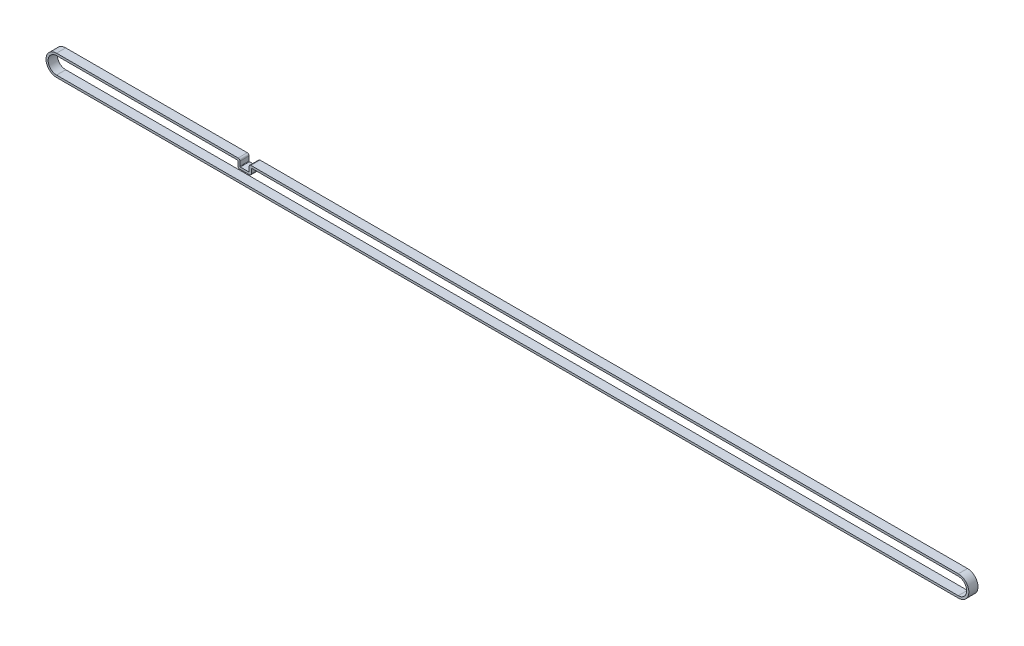
ISO-10303-21;
HEADER;
FILE_DESCRIPTION(('STEP AP214'),'2;1');
FILE_NAME('part.step','',(''),(''),'','','');
FILE_SCHEMA(('AUTOMOTIVE_DESIGN { 1 0 10303 214 1 1 1 1 }'));
ENDSEC;
DATA;
#1=APPLICATION_CONTEXT('core data for automotive mechanical design processes');
#2=APPLICATION_PROTOCOL_DEFINITION('international standard','automotive_design',2000,#1);
#3=PRODUCT_CONTEXT('',#1,'mechanical');
#4=PRODUCT('Part','Part','',(#3));
#5=PRODUCT_RELATED_PRODUCT_CATEGORY('part','',(#4));
#6=PRODUCT_DEFINITION_FORMATION('','',#4);
#7=PRODUCT_DEFINITION_CONTEXT('part definition',#1,'design');
#8=PRODUCT_DEFINITION('design','',#6,#7);
#9=PRODUCT_DEFINITION_SHAPE('','',#8);
#10=(LENGTH_UNIT() NAMED_UNIT(*) SI_UNIT(.MILLI.,.METRE.));
#11=(NAMED_UNIT(*) PLANE_ANGLE_UNIT() SI_UNIT($,.RADIAN.));
#12=(NAMED_UNIT(*) SI_UNIT($,.STERADIAN.) SOLID_ANGLE_UNIT());
#13=UNCERTAINTY_MEASURE_WITH_UNIT(LENGTH_MEASURE(1.E-05),#10,'distance_accuracy_value','');
#14=(GEOMETRIC_REPRESENTATION_CONTEXT(3) GLOBAL_UNCERTAINTY_ASSIGNED_CONTEXT((#13)) GLOBAL_UNIT_ASSIGNED_CONTEXT((#10,
#11,#12)) REPRESENTATION_CONTEXT('',''));
#15=CARTESIAN_POINT('',(0.,0.,0.));
#16=DIRECTION('',(0.,0.,1.));
#17=DIRECTION('',(1.,0.,0.));
#18=AXIS2_PLACEMENT_3D('',#15,#16,#17);
#19=CARTESIAN_POINT('',(0.,0.,6.));
#20=DIRECTION('',(0.,0.,1.));
#21=DIRECTION('',(1.,0.,0.));
#22=AXIS2_PLACEMENT_3D('',#19,#20,#21);
#23=PLANE('',#22);
#24=DIRECTION('',(-1.,0.,0.));
#25=VECTOR('',#24,1.);
#26=CARTESIAN_POINT('',(126.,6.9,6.));
#27=LINE('',#26,#25);
#28=CARTESIAN_POINT('',(590.,6.9,6.));
#29=VERTEX_POINT('',#28);
#30=CARTESIAN_POINT('',(127.2,6.9,6.));
#31=VERTEX_POINT('',#30);
#32=EDGE_CURVE('E270',#29,#31,#27,.T.);
#33=ORIENTED_EDGE('',*,*,#32,.T.);
#34=CARTESIAN_POINT('',(127.2,5.7,6.));
#35=DIRECTION('',(0.,0.,1.));
#36=DIRECTION('',(1.,0.,0.));
#37=AXIS2_PLACEMENT_3D('',#34,#35,#36);
#38=CIRCLE('',#37,1.2);
#39=CARTESIAN_POINT('',(126.,5.7,6.));
#40=VERTEX_POINT('',#39);
#41=EDGE_CURVE('E367',#31,#40,#38,.T.);
#42=ORIENTED_EDGE('',*,*,#41,.T.);
#43=DIRECTION('',(0.,-1.,0.));
#44=VECTOR('',#43,1.);
#45=CARTESIAN_POINT('',(126.,2.5,6.));
#46=LINE('',#45,#44);
#47=CARTESIAN_POINT('',(126.,2.8,6.));
#48=VERTEX_POINT('',#47);
#49=EDGE_CURVE('E273',#40,#48,#46,.T.);
#50=ORIENTED_EDGE('',*,*,#49,.T.);
#51=CARTESIAN_POINT('',(125.7,2.8,6.));
#52=DIRECTION('',(0.,0.,1.));
#53=DIRECTION('',(1.,0.,0.));
#54=AXIS2_PLACEMENT_3D('',#51,#52,#53);
#55=CIRCLE('',#54,0.3);
#56=CARTESIAN_POINT('',(125.7,2.5,6.));
#57=VERTEX_POINT('',#56);
#58=EDGE_CURVE('E345',#48,#57,#55,.F.);
#59=ORIENTED_EDGE('',*,*,#58,.T.);
#60=DIRECTION('',(-1.,0.,0.));
#61=VECTOR('',#60,1.);
#62=CARTESIAN_POINT('',(120.,2.5,6.));
#63=LINE('',#62,#61);
#64=CARTESIAN_POINT('',(120.3,2.5,6.));
#65=VERTEX_POINT('',#64);
#66=EDGE_CURVE('E275',#57,#65,#63,.T.);
#67=ORIENTED_EDGE('',*,*,#66,.T.);
#68=CARTESIAN_POINT('',(120.3,2.8,6.));
#69=DIRECTION('',(0.,0.,1.));
#70=DIRECTION('',(1.,0.,0.));
#71=AXIS2_PLACEMENT_3D('',#68,#69,#70);
#72=CIRCLE('',#71,0.3);
#73=CARTESIAN_POINT('',(120.,2.8,6.));
#74=VERTEX_POINT('',#73);
#75=EDGE_CURVE('E349',#65,#74,#72,.F.);
#76=ORIENTED_EDGE('',*,*,#75,.T.);
#77=DIRECTION('',(0.,1.,0.));
#78=VECTOR('',#77,1.);
#79=CARTESIAN_POINT('',(120.,6.9,6.));
#80=LINE('',#79,#78);
#81=CARTESIAN_POINT('',(120.,5.7,6.));
#82=VERTEX_POINT('',#81);
#83=EDGE_CURVE('E278',#74,#82,#80,.T.);
#84=ORIENTED_EDGE('',*,*,#83,.T.);
#85=CARTESIAN_POINT('',(118.8,5.7,6.));
#86=DIRECTION('',(0.,0.,1.));
#87=DIRECTION('',(1.,0.,0.));
#88=AXIS2_PLACEMENT_3D('',#85,#86,#87);
#89=CIRCLE('',#88,1.2);
#90=CARTESIAN_POINT('',(118.8,6.9,6.));
#91=VERTEX_POINT('',#90);
#92=EDGE_CURVE('E59',#82,#91,#89,.T.);
#93=ORIENTED_EDGE('',*,*,#92,.T.);
#94=DIRECTION('',(-1.,0.,0.));
#95=VECTOR('',#94,1.);
#96=CARTESIAN_POINT('',(0.,6.9,6.));
#97=LINE('',#96,#95);
#98=CARTESIAN_POINT('',(0.,6.9,6.));
#99=VERTEX_POINT('',#98);
#100=EDGE_CURVE('E280',#91,#99,#97,.T.);
#101=ORIENTED_EDGE('',*,*,#100,.T.);
#102=CARTESIAN_POINT('',(0.,0.,6.));
#103=DIRECTION('',(0.,0.,1.));
#104=DIRECTION('',(1.,0.,0.));
#105=AXIS2_PLACEMENT_3D('',#102,#103,#104);
#106=CIRCLE('',#105,6.9);
#107=CARTESIAN_POINT('',(0.,-6.9,6.));
#108=VERTEX_POINT('',#107);
#109=EDGE_CURVE('E262',#99,#108,#106,.T.);
#110=ORIENTED_EDGE('',*,*,#109,.T.);
#111=DIRECTION('',(1.,0.,0.));
#112=VECTOR('',#111,1.);
#113=CARTESIAN_POINT('',(0.,-6.9,6.));
#114=LINE('',#113,#112);
#115=CARTESIAN_POINT('',(590.,-6.9,6.));
#116=VERTEX_POINT('',#115);
#117=EDGE_CURVE('E265',#108,#116,#114,.T.);
#118=ORIENTED_EDGE('',*,*,#117,.T.);
#119=CARTESIAN_POINT('',(590.,0.,6.));
#120=DIRECTION('',(0.,0.,1.));
#121=DIRECTION('',(1.,0.,0.));
#122=AXIS2_PLACEMENT_3D('',#119,#120,#121);
#123=CIRCLE('',#122,6.9);
#124=EDGE_CURVE('E268',#116,#29,#123,.T.);
#125=ORIENTED_EDGE('',*,*,#124,.T.);
#126=EDGE_LOOP('',(#33,#42,#50,#59,#67,#76,#84,#93,#101,#110,#118,#125));
#127=FACE_BOUND('',#126,.T.);
#128=DIRECTION('',(0.,1.,0.));
#129=VECTOR('',#128,1.);
#130=CARTESIAN_POINT('',(118.6,5.5,6.));
#131=LINE('',#130,#129);
#132=CARTESIAN_POINT('',(118.6,2.3,6.));
#133=VERTEX_POINT('',#132);
#134=CARTESIAN_POINT('',(118.6,5.2,6.));
#135=VERTEX_POINT('',#134);
#136=EDGE_CURVE('E236',#133,#135,#131,.T.);
#137=ORIENTED_EDGE('',*,*,#136,.F.);
#138=CARTESIAN_POINT('',(119.8,2.3,6.));
#139=DIRECTION('',(0.,0.,1.));
#140=DIRECTION('',(1.,0.,0.));
#141=AXIS2_PLACEMENT_3D('',#138,#139,#140);
#142=CIRCLE('',#141,1.2);
#143=CARTESIAN_POINT('',(119.8,1.1,6.));
#144=VERTEX_POINT('',#143);
#145=EDGE_CURVE('E370',#133,#144,#142,.T.);
#146=ORIENTED_EDGE('',*,*,#145,.T.);
#147=DIRECTION('',(-1.,0.,0.));
#148=VECTOR('',#147,1.);
#149=CARTESIAN_POINT('',(118.6,1.1,6.));
#150=LINE('',#149,#148);
#151=CARTESIAN_POINT('',(126.2,1.1,6.));
#152=VERTEX_POINT('',#151);
#153=EDGE_CURVE('E233',#152,#144,#150,.T.);
#154=ORIENTED_EDGE('',*,*,#153,.F.);
#155=CARTESIAN_POINT('',(126.2,2.3,6.));
#156=DIRECTION('',(0.,0.,1.));
#157=DIRECTION('',(1.,0.,0.));
#158=AXIS2_PLACEMENT_3D('',#155,#156,#157);
#159=CIRCLE('',#158,1.2);
#160=CARTESIAN_POINT('',(127.4,2.3,6.));
#161=VERTEX_POINT('',#160);
#162=EDGE_CURVE('E51',#152,#161,#159,.T.);
#163=ORIENTED_EDGE('',*,*,#162,.T.);
#164=DIRECTION('',(0.,-1.,0.));
#165=VECTOR('',#164,1.);
#166=CARTESIAN_POINT('',(127.4,1.1,6.));
#167=LINE('',#166,#165);
#168=CARTESIAN_POINT('',(127.4,5.2,6.));
#169=VERTEX_POINT('',#168);
#170=EDGE_CURVE('E231',#169,#161,#167,.T.);
#171=ORIENTED_EDGE('',*,*,#170,.F.);
#172=CARTESIAN_POINT('',(127.7,5.2,6.));
#173=DIRECTION('',(0.,0.,1.));
#174=DIRECTION('',(1.,0.,0.));
#175=AXIS2_PLACEMENT_3D('',#172,#173,#174);
#176=CIRCLE('',#175,0.3);
#177=CARTESIAN_POINT('',(127.7,5.5,6.));
#178=VERTEX_POINT('',#177);
#179=EDGE_CURVE('E335',#169,#178,#176,.F.);
#180=ORIENTED_EDGE('',*,*,#179,.T.);
#181=DIRECTION('',(-1.,0.,0.));
#182=VECTOR('',#181,1.);
#183=CARTESIAN_POINT('',(127.4,5.5,6.));
#184=LINE('',#183,#182);
#185=CARTESIAN_POINT('',(590.,5.5,6.));
#186=VERTEX_POINT('',#185);
#187=EDGE_CURVE('E226',#186,#178,#184,.T.);
#188=ORIENTED_EDGE('',*,*,#187,.F.);
#189=CARTESIAN_POINT('',(590.,0.,6.));
#190=DIRECTION('',(0.,0.,1.));
#191=DIRECTION('',(1.,0.,0.));
#192=AXIS2_PLACEMENT_3D('',#189,#190,#191);
#193=CIRCLE('',#192,5.5);
#194=CARTESIAN_POINT('',(590.,-5.5,6.));
#195=VERTEX_POINT('',#194);
#196=EDGE_CURVE('E224',#195,#186,#193,.T.);
#197=ORIENTED_EDGE('',*,*,#196,.F.);
#198=DIRECTION('',(1.,0.,0.));
#199=VECTOR('',#198,1.);
#200=CARTESIAN_POINT('',(0.,-5.5,6.));
#201=LINE('',#200,#199);
#202=CARTESIAN_POINT('',(0.,-5.5,6.));
#203=VERTEX_POINT('',#202);
#204=EDGE_CURVE('E210',#203,#195,#201,.T.);
#205=ORIENTED_EDGE('',*,*,#204,.F.);
#206=CARTESIAN_POINT('',(0.,0.,6.));
#207=DIRECTION('',(0.,0.,1.));
#208=DIRECTION('',(1.,0.,0.));
#209=AXIS2_PLACEMENT_3D('',#206,#207,#208);
#210=CIRCLE('',#209,5.5);
#211=CARTESIAN_POINT('',(0.,5.5,6.));
#212=VERTEX_POINT('',#211);
#213=EDGE_CURVE('E200',#212,#203,#210,.T.);
#214=ORIENTED_EDGE('',*,*,#213,.F.);
#215=DIRECTION('',(-1.,0.,0.));
#216=VECTOR('',#215,1.);
#217=CARTESIAN_POINT('',(0.,5.5,6.));
#218=LINE('',#217,#216);
#219=CARTESIAN_POINT('',(118.3,5.5,6.));
#220=VERTEX_POINT('',#219);
#221=EDGE_CURVE('E238',#220,#212,#218,.T.);
#222=ORIENTED_EDGE('',*,*,#221,.F.);
#223=CARTESIAN_POINT('',(118.3,5.2,6.));
#224=DIRECTION('',(0.,0.,1.));
#225=DIRECTION('',(1.,0.,0.));
#226=AXIS2_PLACEMENT_3D('',#223,#224,#225);
#227=CIRCLE('',#226,0.3);
#228=EDGE_CURVE('E339',#220,#135,#227,.F.);
#229=ORIENTED_EDGE('',*,*,#228,.T.);
#230=EDGE_LOOP('',(#137,#146,#154,#163,#171,#180,#188,#197,#205,#214,#222,#229));
#231=FACE_BOUND('',#230,.T.);
#232=ADVANCED_FACE('F36',(#127,#231),#23,.T.);
#233=CARTESIAN_POINT('',(0.,0.,0.));
#234=DIRECTION('',(0.,0.,1.));
#235=DIRECTION('',(1.,0.,0.));
#236=AXIS2_PLACEMENT_3D('',#233,#234,#235);
#237=PLANE('',#236);
#238=DIRECTION('',(0.,-1.,0.));
#239=VECTOR('',#238,1.);
#240=CARTESIAN_POINT('',(126.,2.5,0.));
#241=LINE('',#240,#239);
#242=CARTESIAN_POINT('',(126.,5.7,0.));
#243=VERTEX_POINT('',#242);
#244=CARTESIAN_POINT('',(126.,2.8,0.));
#245=VERTEX_POINT('',#244);
#246=EDGE_CURVE('E292',#243,#245,#241,.T.);
#247=ORIENTED_EDGE('',*,*,#246,.F.);
#248=CARTESIAN_POINT('',(127.2,5.7,0.));
#249=DIRECTION('',(0.,0.,1.));
#250=DIRECTION('',(1.,0.,0.));
#251=AXIS2_PLACEMENT_3D('',#248,#249,#250);
#252=CIRCLE('',#251,1.2);
#253=CARTESIAN_POINT('',(127.2,6.9,0.));
#254=VERTEX_POINT('',#253);
#255=EDGE_CURVE('E358',#243,#254,#252,.F.);
#256=ORIENTED_EDGE('',*,*,#255,.T.);
#257=DIRECTION('',(-1.,0.,0.));
#258=VECTOR('',#257,1.);
#259=CARTESIAN_POINT('',(126.,6.9,0.));
#260=LINE('',#259,#258);
#261=CARTESIAN_POINT('',(590.,6.9,0.));
#262=VERTEX_POINT('',#261);
#263=EDGE_CURVE('E289',#262,#254,#260,.T.);
#264=ORIENTED_EDGE('',*,*,#263,.F.);
#265=CARTESIAN_POINT('',(590.,0.,0.));
#266=DIRECTION('',(0.,0.,1.));
#267=DIRECTION('',(1.,0.,0.));
#268=AXIS2_PLACEMENT_3D('',#265,#266,#267);
#269=CIRCLE('',#268,6.9);
#270=CARTESIAN_POINT('',(590.,-6.9,0.));
#271=VERTEX_POINT('',#270);
#272=EDGE_CURVE('E287',#271,#262,#269,.T.);
#273=ORIENTED_EDGE('',*,*,#272,.F.);
#274=DIRECTION('',(1.,0.,0.));
#275=VECTOR('',#274,1.);
#276=CARTESIAN_POINT('',(0.,-6.9,0.));
#277=LINE('',#276,#275);
#278=CARTESIAN_POINT('',(0.,-6.9,0.));
#279=VERTEX_POINT('',#278);
#280=EDGE_CURVE('E285',#279,#271,#277,.T.);
#281=ORIENTED_EDGE('',*,*,#280,.F.);
#282=CARTESIAN_POINT('',(0.,0.,0.));
#283=DIRECTION('',(0.,0.,1.));
#284=DIRECTION('',(1.,0.,0.));
#285=AXIS2_PLACEMENT_3D('',#282,#283,#284);
#286=CIRCLE('',#285,6.9);
#287=CARTESIAN_POINT('',(0.,6.9,0.));
#288=VERTEX_POINT('',#287);
#289=EDGE_CURVE('E218',#288,#279,#286,.T.);
#290=ORIENTED_EDGE('',*,*,#289,.F.);
#291=DIRECTION('',(-1.,0.,0.));
#292=VECTOR('',#291,1.);
#293=CARTESIAN_POINT('',(0.,6.9,0.));
#294=LINE('',#293,#292);
#295=CARTESIAN_POINT('',(118.8,6.9,0.));
#296=VERTEX_POINT('',#295);
#297=EDGE_CURVE('E266',#296,#288,#294,.T.);
#298=ORIENTED_EDGE('',*,*,#297,.F.);
#299=CARTESIAN_POINT('',(118.8,5.7,0.));
#300=DIRECTION('',(0.,0.,1.));
#301=DIRECTION('',(1.,0.,0.));
#302=AXIS2_PLACEMENT_3D('',#299,#300,#301);
#303=CIRCLE('',#302,1.2);
#304=CARTESIAN_POINT('',(120.,5.7,0.));
#305=VERTEX_POINT('',#304);
#306=EDGE_CURVE('E356',#296,#305,#303,.F.);
#307=ORIENTED_EDGE('',*,*,#306,.T.);
#308=DIRECTION('',(0.,1.,0.));
#309=VECTOR('',#308,1.);
#310=CARTESIAN_POINT('',(120.,6.9,0.));
#311=LINE('',#310,#309);
#312=CARTESIAN_POINT('',(120.,2.8,0.));
#313=VERTEX_POINT('',#312);
#314=EDGE_CURVE('E297',#313,#305,#311,.T.);
#315=ORIENTED_EDGE('',*,*,#314,.F.);
#316=CARTESIAN_POINT('',(120.3,2.8,0.));
#317=DIRECTION('',(0.,0.,1.));
#318=DIRECTION('',(1.,0.,0.));
#319=AXIS2_PLACEMENT_3D('',#316,#317,#318);
#320=CIRCLE('',#319,0.3);
#321=CARTESIAN_POINT('',(120.3,2.5,0.));
#322=VERTEX_POINT('',#321);
#323=EDGE_CURVE('E347',#313,#322,#320,.T.);
#324=ORIENTED_EDGE('',*,*,#323,.T.);
#325=DIRECTION('',(-1.,0.,0.));
#326=VECTOR('',#325,1.);
#327=CARTESIAN_POINT('',(120.,2.5,0.));
#328=LINE('',#327,#326);
#329=CARTESIAN_POINT('',(125.7,2.5,0.));
#330=VERTEX_POINT('',#329);
#331=EDGE_CURVE('E294',#330,#322,#328,.T.);
#332=ORIENTED_EDGE('',*,*,#331,.F.);
#333=CARTESIAN_POINT('',(125.7,2.8,0.));
#334=DIRECTION('',(0.,0.,1.));
#335=DIRECTION('',(1.,0.,0.));
#336=AXIS2_PLACEMENT_3D('',#333,#334,#335);
#337=CIRCLE('',#336,0.3);
#338=EDGE_CURVE('E342',#330,#245,#337,.T.);
#339=ORIENTED_EDGE('',*,*,#338,.T.);
#340=EDGE_LOOP('',(#247,#256,#264,#273,#281,#290,#298,#307,#315,#324,#332,#339));
#341=FACE_BOUND('',#340,.T.);
#342=DIRECTION('',(-1.,0.,0.));
#343=VECTOR('',#342,1.);
#344=CARTESIAN_POINT('',(118.6,1.1,0.));
#345=LINE('',#344,#343);
#346=CARTESIAN_POINT('',(126.2,1.1,0.));
#347=VERTEX_POINT('',#346);
#348=CARTESIAN_POINT('',(119.8,1.1,0.));
#349=VERTEX_POINT('',#348);
#350=EDGE_CURVE('E252',#347,#349,#345,.T.);
#351=ORIENTED_EDGE('',*,*,#350,.T.);
#352=CARTESIAN_POINT('',(119.8,2.3,0.));
#353=DIRECTION('',(0.,0.,1.));
#354=DIRECTION('',(1.,0.,0.));
#355=AXIS2_PLACEMENT_3D('',#352,#353,#354);
#356=CIRCLE('',#355,1.2);
#357=CARTESIAN_POINT('',(118.6,2.3,0.));
#358=VERTEX_POINT('',#357);
#359=EDGE_CURVE('E362',#349,#358,#356,.F.);
#360=ORIENTED_EDGE('',*,*,#359,.T.);
#361=DIRECTION('',(0.,1.,0.));
#362=VECTOR('',#361,1.);
#363=CARTESIAN_POINT('',(118.6,5.5,0.));
#364=LINE('',#363,#362);
#365=CARTESIAN_POINT('',(118.6,5.2,0.));
#366=VERTEX_POINT('',#365);
#367=EDGE_CURVE('E255',#358,#366,#364,.T.);
#368=ORIENTED_EDGE('',*,*,#367,.T.);
#369=CARTESIAN_POINT('',(118.3,5.2,0.));
#370=DIRECTION('',(0.,0.,1.));
#371=DIRECTION('',(1.,0.,0.));
#372=AXIS2_PLACEMENT_3D('',#369,#370,#371);
#373=CIRCLE('',#372,0.3);
#374=CARTESIAN_POINT('',(118.3,5.5,0.));
#375=VERTEX_POINT('',#374);
#376=EDGE_CURVE('E337',#366,#375,#373,.T.);
#377=ORIENTED_EDGE('',*,*,#376,.T.);
#378=DIRECTION('',(-1.,0.,0.));
#379=VECTOR('',#378,1.);
#380=CARTESIAN_POINT('',(0.,5.5,0.));
#381=LINE('',#380,#379);
#382=CARTESIAN_POINT('',(0.,5.5,0.));
#383=VERTEX_POINT('',#382);
#384=EDGE_CURVE('E211',#375,#383,#381,.T.);
#385=ORIENTED_EDGE('',*,*,#384,.T.);
#386=CARTESIAN_POINT('',(0.,0.,0.));
#387=DIRECTION('',(0.,0.,1.));
#388=DIRECTION('',(1.,0.,0.));
#389=AXIS2_PLACEMENT_3D('',#386,#387,#388);
#390=CIRCLE('',#389,5.5);
#391=CARTESIAN_POINT('',(0.,-5.5,0.));
#392=VERTEX_POINT('',#391);
#393=EDGE_CURVE('E240',#383,#392,#390,.T.);
#394=ORIENTED_EDGE('',*,*,#393,.T.);
#395=DIRECTION('',(1.,0.,0.));
#396=VECTOR('',#395,1.);
#397=CARTESIAN_POINT('',(0.,-5.5,0.));
#398=LINE('',#397,#396);
#399=CARTESIAN_POINT('',(590.,-5.5,0.));
#400=VERTEX_POINT('',#399);
#401=EDGE_CURVE('E217',#392,#400,#398,.T.);
#402=ORIENTED_EDGE('',*,*,#401,.T.);
#403=CARTESIAN_POINT('',(590.,0.,0.));
#404=DIRECTION('',(0.,0.,1.));
#405=DIRECTION('',(1.,0.,0.));
#406=AXIS2_PLACEMENT_3D('',#403,#404,#405);
#407=CIRCLE('',#406,5.5);
#408=CARTESIAN_POINT('',(590.,5.5,0.));
#409=VERTEX_POINT('',#408);
#410=EDGE_CURVE('E243',#400,#409,#407,.T.);
#411=ORIENTED_EDGE('',*,*,#410,.T.);
#412=DIRECTION('',(-1.,0.,0.));
#413=VECTOR('',#412,1.);
#414=CARTESIAN_POINT('',(127.4,5.5,0.));
#415=LINE('',#414,#413);
#416=CARTESIAN_POINT('',(127.7,5.5,0.));
#417=VERTEX_POINT('',#416);
#418=EDGE_CURVE('E246',#409,#417,#415,.T.);
#419=ORIENTED_EDGE('',*,*,#418,.T.);
#420=CARTESIAN_POINT('',(127.7,5.2,0.));
#421=DIRECTION('',(0.,0.,1.));
#422=DIRECTION('',(1.,0.,0.));
#423=AXIS2_PLACEMENT_3D('',#420,#421,#422);
#424=CIRCLE('',#423,0.3);
#425=CARTESIAN_POINT('',(127.4,5.2,0.));
#426=VERTEX_POINT('',#425);
#427=EDGE_CURVE('E333',#417,#426,#424,.T.);
#428=ORIENTED_EDGE('',*,*,#427,.T.);
#429=DIRECTION('',(0.,-1.,0.));
#430=VECTOR('',#429,1.);
#431=CARTESIAN_POINT('',(127.4,1.1,0.));
#432=LINE('',#431,#430);
#433=CARTESIAN_POINT('',(127.4,2.3,0.));
#434=VERTEX_POINT('',#433);
#435=EDGE_CURVE('E249',#426,#434,#432,.T.);
#436=ORIENTED_EDGE('',*,*,#435,.T.);
#437=CARTESIAN_POINT('',(126.2,2.3,0.));
#438=DIRECTION('',(0.,0.,1.));
#439=DIRECTION('',(1.,0.,0.));
#440=AXIS2_PLACEMENT_3D('',#437,#438,#439);
#441=CIRCLE('',#440,1.2);
#442=EDGE_CURVE('E360',#434,#347,#441,.F.);
#443=ORIENTED_EDGE('',*,*,#442,.T.);
#444=EDGE_LOOP('',(#351,#360,#368,#377,#385,#394,#402,#411,#419,#428,#436,#443));
#445=FACE_BOUND('',#444,.T.);
#446=ADVANCED_FACE('F389',(#341,#445),#237,.F.);
#447=CARTESIAN_POINT('',(0.,0.,6.));
#448=DIRECTION('',(0.,0.,-1.));
#449=DIRECTION('',(-1.,0.,0.));
#450=AXIS2_PLACEMENT_3D('',#447,#448,#449);
#451=CYLINDRICAL_SURFACE('',#450,6.9);
#452=ORIENTED_EDGE('',*,*,#289,.T.);
#453=DIRECTION('',(0.,0.,-1.));
#454=VECTOR('',#453,1.);
#455=CARTESIAN_POINT('',(0.,-6.9,6.));
#456=LINE('',#455,#454);
#457=EDGE_CURVE('E309',#108,#279,#456,.T.);
#458=ORIENTED_EDGE('',*,*,#457,.F.);
#459=ORIENTED_EDGE('',*,*,#109,.F.);
#460=DIRECTION('',(0.,0.,-1.));
#461=VECTOR('',#460,1.);
#462=CARTESIAN_POINT('',(0.,6.9,6.));
#463=LINE('',#462,#461);
#464=EDGE_CURVE('E282',#99,#288,#463,.T.);
#465=ORIENTED_EDGE('',*,*,#464,.T.);
#466=EDGE_LOOP('',(#452,#458,#459,#465));
#467=FACE_BOUND('',#466,.T.);
#468=ADVANCED_FACE('F395',(#467),#451,.T.);
#469=CARTESIAN_POINT('',(0.,-6.9,6.));
#470=DIRECTION('',(0.,1.,0.));
#471=DIRECTION('',(0.,0.,1.));
#472=AXIS2_PLACEMENT_3D('',#469,#470,#471);
#473=PLANE('',#472);
#474=ORIENTED_EDGE('',*,*,#280,.T.);
#475=DIRECTION('',(0.,0.,-1.));
#476=VECTOR('',#475,1.);
#477=CARTESIAN_POINT('',(590.,-6.9,6.));
#478=LINE('',#477,#476);
#479=EDGE_CURVE('E306',#116,#271,#478,.T.);
#480=ORIENTED_EDGE('',*,*,#479,.F.);
#481=ORIENTED_EDGE('',*,*,#117,.F.);
#482=ORIENTED_EDGE('',*,*,#457,.T.);
#483=EDGE_LOOP('',(#474,#480,#481,#482));
#484=FACE_BOUND('',#483,.T.);
#485=ADVANCED_FACE('F401',(#484),#473,.F.);
#486=CARTESIAN_POINT('',(590.,0.,6.));
#487=DIRECTION('',(0.,0.,-1.));
#488=DIRECTION('',(-1.,0.,0.));
#489=AXIS2_PLACEMENT_3D('',#486,#487,#488);
#490=CYLINDRICAL_SURFACE('',#489,6.9);
#491=ORIENTED_EDGE('',*,*,#272,.T.);
#492=DIRECTION('',(0.,0.,-1.));
#493=VECTOR('',#492,1.);
#494=CARTESIAN_POINT('',(590.,6.9,6.));
#495=LINE('',#494,#493);
#496=EDGE_CURVE('E303',#29,#262,#495,.T.);
#497=ORIENTED_EDGE('',*,*,#496,.F.);
#498=ORIENTED_EDGE('',*,*,#124,.F.);
#499=ORIENTED_EDGE('',*,*,#479,.T.);
#500=EDGE_LOOP('',(#491,#497,#498,#499));
#501=FACE_BOUND('',#500,.T.);
#502=ADVANCED_FACE('F403',(#501),#490,.T.);
#503=CARTESIAN_POINT('',(126.,6.9,6.));
#504=DIRECTION('',(0.,-1.,0.));
#505=DIRECTION('',(0.,0.,-1.));
#506=AXIS2_PLACEMENT_3D('',#503,#504,#505);
#507=PLANE('',#506);
#508=ORIENTED_EDGE('',*,*,#263,.T.);
#509=DIRECTION('',(0.,0.,-1.));
#510=VECTOR('',#509,1.);
#511=CARTESIAN_POINT('',(127.2,6.9,6.));
#512=LINE('',#511,#510);
#513=EDGE_CURVE('E378',#254,#31,#512,.F.);
#514=ORIENTED_EDGE('',*,*,#513,.T.);
#515=ORIENTED_EDGE('',*,*,#32,.F.);
#516=ORIENTED_EDGE('',*,*,#496,.T.);
#517=EDGE_LOOP('',(#508,#514,#515,#516));
#518=FACE_BOUND('',#517,.T.);
#519=ADVANCED_FACE('F407',(#518),#507,.F.);
#520=CARTESIAN_POINT('',(126.,2.5,6.));
#521=DIRECTION('',(1.,0.,0.));
#522=DIRECTION('',(0.,0.,-1.));
#523=AXIS2_PLACEMENT_3D('',#520,#521,#522);
#524=PLANE('',#523);
#525=ORIENTED_EDGE('',*,*,#49,.F.);
#526=DIRECTION('',(0.,0.,-1.));
#527=VECTOR('',#526,1.);
#528=CARTESIAN_POINT('',(126.,5.7,6.));
#529=LINE('',#528,#527);
#530=EDGE_CURVE('E375',#40,#243,#529,.T.);
#531=ORIENTED_EDGE('',*,*,#530,.T.);
#532=ORIENTED_EDGE('',*,*,#246,.T.);
#533=DIRECTION('',(0.,0.,-1.));
#534=VECTOR('',#533,1.);
#535=CARTESIAN_POINT('',(126.,2.8,6.));
#536=LINE('',#535,#534);
#537=EDGE_CURVE('E327',#245,#48,#536,.F.);
#538=ORIENTED_EDGE('',*,*,#537,.T.);
#539=EDGE_LOOP('',(#525,#531,#532,#538));
#540=FACE_BOUND('',#539,.T.);
#541=ADVANCED_FACE('F415',(#540),#524,.F.);
#542=CARTESIAN_POINT('',(120.,2.5,6.));
#543=DIRECTION('',(0.,-1.,0.));
#544=DIRECTION('',(1.,0.,0.));
#545=AXIS2_PLACEMENT_3D('',#542,#543,#544);
#546=PLANE('',#545);
#547=ORIENTED_EDGE('',*,*,#66,.F.);
#548=DIRECTION('',(0.,0.,-1.));
#549=VECTOR('',#548,1.);
#550=CARTESIAN_POINT('',(125.7,2.5,0.));
#551=LINE('',#550,#549);
#552=EDGE_CURVE('E324',#57,#330,#551,.T.);
#553=ORIENTED_EDGE('',*,*,#552,.T.);
#554=ORIENTED_EDGE('',*,*,#331,.T.);
#555=DIRECTION('',(0.,0.,-1.));
#556=VECTOR('',#555,1.);
#557=CARTESIAN_POINT('',(120.3,2.5,6.));
#558=LINE('',#557,#556);
#559=EDGE_CURVE('E322',#322,#65,#558,.F.);
#560=ORIENTED_EDGE('',*,*,#559,.T.);
#561=EDGE_LOOP('',(#547,#553,#554,#560));
#562=FACE_BOUND('',#561,.T.);
#563=ADVANCED_FACE('F425',(#562),#546,.F.);
#564=CARTESIAN_POINT('',(120.,6.9,6.));
#565=DIRECTION('',(-1.,0.,0.));
#566=DIRECTION('',(0.,0.,1.));
#567=AXIS2_PLACEMENT_3D('',#564,#565,#566);
#568=PLANE('',#567);
#569=ORIENTED_EDGE('',*,*,#314,.T.);
#570=DIRECTION('',(0.,0.,-1.));
#571=VECTOR('',#570,1.);
#572=CARTESIAN_POINT('',(120.,5.7,6.));
#573=LINE('',#572,#571);
#574=EDGE_CURVE('E11',#305,#82,#573,.F.);
#575=ORIENTED_EDGE('',*,*,#574,.T.);
#576=ORIENTED_EDGE('',*,*,#83,.F.);
#577=DIRECTION('',(0.,0.,-1.));
#578=VECTOR('',#577,1.);
#579=CARTESIAN_POINT('',(120.,2.8,0.));
#580=LINE('',#579,#578);
#581=EDGE_CURVE('E330',#74,#313,#580,.T.);
#582=ORIENTED_EDGE('',*,*,#581,.T.);
#583=EDGE_LOOP('',(#569,#575,#576,#582));
#584=FACE_BOUND('',#583,.T.);
#585=ADVANCED_FACE('F432',(#584),#568,.F.);
#586=CARTESIAN_POINT('',(0.,6.9,6.));
#587=DIRECTION('',(0.,-1.,0.));
#588=DIRECTION('',(0.,0.,-1.));
#589=AXIS2_PLACEMENT_3D('',#586,#587,#588);
#590=PLANE('',#589);
#591=ORIENTED_EDGE('',*,*,#100,.F.);
#592=DIRECTION('',(0.,0.,-1.));
#593=VECTOR('',#592,1.);
#594=CARTESIAN_POINT('',(118.8,6.9,6.));
#595=LINE('',#594,#593);
#596=EDGE_CURVE('E44',#91,#296,#595,.T.);
#597=ORIENTED_EDGE('',*,*,#596,.T.);
#598=ORIENTED_EDGE('',*,*,#297,.T.);
#599=ORIENTED_EDGE('',*,*,#464,.F.);
#600=EDGE_LOOP('',(#591,#597,#598,#599));
#601=FACE_BOUND('',#600,.T.);
#602=ADVANCED_FACE('F383',(#601),#590,.F.);
#603=CARTESIAN_POINT('',(0.,0.,6.));
#604=DIRECTION('',(0.,0.,-1.));
#605=DIRECTION('',(-1.,0.,0.));
#606=AXIS2_PLACEMENT_3D('',#603,#604,#605);
#607=CYLINDRICAL_SURFACE('',#606,5.5);
#608=ORIENTED_EDGE('',*,*,#393,.F.);
#609=DIRECTION('',(0.,0.,-1.));
#610=VECTOR('',#609,1.);
#611=CARTESIAN_POINT('',(0.,5.5,6.));
#612=LINE('',#611,#610);
#613=EDGE_CURVE('E207',#212,#383,#612,.T.);
#614=ORIENTED_EDGE('',*,*,#613,.F.);
#615=ORIENTED_EDGE('',*,*,#213,.T.);
#616=DIRECTION('',(0.,0.,-1.));
#617=VECTOR('',#616,1.);
#618=CARTESIAN_POINT('',(0.,-5.5,6.));
#619=LINE('',#618,#617);
#620=EDGE_CURVE('E204',#203,#392,#619,.T.);
#621=ORIENTED_EDGE('',*,*,#620,.T.);
#622=EDGE_LOOP('',(#608,#614,#615,#621));
#623=FACE_BOUND('',#622,.T.);
#624=ADVANCED_FACE('F203',(#623),#607,.F.);
#625=CARTESIAN_POINT('',(0.,-5.5,6.));
#626=DIRECTION('',(0.,1.,0.));
#627=DIRECTION('',(0.,0.,1.));
#628=AXIS2_PLACEMENT_3D('',#625,#626,#627);
#629=PLANE('',#628);
#630=ORIENTED_EDGE('',*,*,#401,.F.);
#631=ORIENTED_EDGE('',*,*,#620,.F.);
#632=ORIENTED_EDGE('',*,*,#204,.T.);
#633=DIRECTION('',(0.,0.,-1.));
#634=VECTOR('',#633,1.);
#635=CARTESIAN_POINT('',(590.,-5.5,6.));
#636=LINE('',#635,#634);
#637=EDGE_CURVE('E219',#195,#400,#636,.T.);
#638=ORIENTED_EDGE('',*,*,#637,.T.);
#639=EDGE_LOOP('',(#630,#631,#632,#638));
#640=FACE_BOUND('',#639,.T.);
#641=ADVANCED_FACE('F214',(#640),#629,.T.);
#642=CARTESIAN_POINT('',(590.,0.,6.));
#643=DIRECTION('',(0.,0.,-1.));
#644=DIRECTION('',(-1.,0.,0.));
#645=AXIS2_PLACEMENT_3D('',#642,#643,#644);
#646=CYLINDRICAL_SURFACE('',#645,5.5);
#647=ORIENTED_EDGE('',*,*,#410,.F.);
#648=ORIENTED_EDGE('',*,*,#637,.F.);
#649=ORIENTED_EDGE('',*,*,#196,.T.);
#650=DIRECTION('',(0.,0.,-1.));
#651=VECTOR('',#650,1.);
#652=CARTESIAN_POINT('',(590.,5.5,6.));
#653=LINE('',#652,#651);
#654=EDGE_CURVE('E259',#186,#409,#653,.T.);
#655=ORIENTED_EDGE('',*,*,#654,.T.);
#656=EDGE_LOOP('',(#647,#648,#649,#655));
#657=FACE_BOUND('',#656,.T.);
#658=ADVANCED_FACE('F500',(#657),#646,.F.);
#659=CARTESIAN_POINT('',(127.4,5.5,6.));
#660=DIRECTION('',(0.,-1.,0.));
#661=DIRECTION('',(0.,0.,-1.));
#662=AXIS2_PLACEMENT_3D('',#659,#660,#661);
#663=PLANE('',#662);
#664=ORIENTED_EDGE('',*,*,#187,.T.);
#665=DIRECTION('',(0.,0.,-1.));
#666=VECTOR('',#665,1.);
#667=CARTESIAN_POINT('',(127.7,5.5,0.));
#668=LINE('',#667,#666);
#669=EDGE_CURVE('E312',#178,#417,#668,.T.);
#670=ORIENTED_EDGE('',*,*,#669,.T.);
#671=ORIENTED_EDGE('',*,*,#418,.F.);
#672=ORIENTED_EDGE('',*,*,#654,.F.);
#673=EDGE_LOOP('',(#664,#670,#671,#672));
#674=FACE_BOUND('',#673,.T.);
#675=ADVANCED_FACE('F496',(#674),#663,.T.);
#676=CARTESIAN_POINT('',(127.4,1.1,6.));
#677=DIRECTION('',(1.,0.,0.));
#678=DIRECTION('',(0.,0.,-1.));
#679=AXIS2_PLACEMENT_3D('',#676,#677,#678);
#680=PLANE('',#679);
#681=ORIENTED_EDGE('',*,*,#170,.T.);
#682=DIRECTION('',(0.,0.,-1.));
#683=VECTOR('',#682,1.);
#684=CARTESIAN_POINT('',(127.4,2.3,6.));
#685=LINE('',#684,#683);
#686=EDGE_CURVE('E372',#161,#434,#685,.T.);
#687=ORIENTED_EDGE('',*,*,#686,.T.);
#688=ORIENTED_EDGE('',*,*,#435,.F.);
#689=DIRECTION('',(0.,0.,-1.));
#690=VECTOR('',#689,1.);
#691=CARTESIAN_POINT('',(127.4,5.2,6.));
#692=LINE('',#691,#690);
#693=EDGE_CURVE('E315',#426,#169,#692,.F.);
#694=ORIENTED_EDGE('',*,*,#693,.T.);
#695=EDGE_LOOP('',(#681,#687,#688,#694));
#696=FACE_BOUND('',#695,.T.);
#697=ADVANCED_FACE('F489',(#696),#680,.T.);
#698=CARTESIAN_POINT('',(118.6,1.1,6.));
#699=DIRECTION('',(0.,-1.,0.));
#700=DIRECTION('',(0.,0.,-1.));
#701=AXIS2_PLACEMENT_3D('',#698,#699,#700);
#702=PLANE('',#701);
#703=ORIENTED_EDGE('',*,*,#153,.T.);
#704=DIRECTION('',(0.,0.,-1.));
#705=VECTOR('',#704,1.);
#706=CARTESIAN_POINT('',(119.8,1.1,6.));
#707=LINE('',#706,#705);
#708=EDGE_CURVE('E353',#144,#349,#707,.T.);
#709=ORIENTED_EDGE('',*,*,#708,.T.);
#710=ORIENTED_EDGE('',*,*,#350,.F.);
#711=DIRECTION('',(0.,0.,-1.));
#712=VECTOR('',#711,1.);
#713=CARTESIAN_POINT('',(126.2,1.1,6.));
#714=LINE('',#713,#712);
#715=EDGE_CURVE('E351',#347,#152,#714,.F.);
#716=ORIENTED_EDGE('',*,*,#715,.T.);
#717=EDGE_LOOP('',(#703,#709,#710,#716));
#718=FACE_BOUND('',#717,.T.);
#719=ADVANCED_FACE('F514',(#718),#702,.T.);
#720=CARTESIAN_POINT('',(118.6,5.5,6.));
#721=DIRECTION('',(-1.,0.,0.));
#722=DIRECTION('',(0.,0.,1.));
#723=AXIS2_PLACEMENT_3D('',#720,#721,#722);
#724=PLANE('',#723);
#725=ORIENTED_EDGE('',*,*,#367,.F.);
#726=DIRECTION('',(0.,0.,-1.));
#727=VECTOR('',#726,1.);
#728=CARTESIAN_POINT('',(118.6,2.3,6.));
#729=LINE('',#728,#727);
#730=EDGE_CURVE('E364',#358,#133,#729,.F.);
#731=ORIENTED_EDGE('',*,*,#730,.T.);
#732=ORIENTED_EDGE('',*,*,#136,.T.);
#733=DIRECTION('',(0.,0.,-1.));
#734=VECTOR('',#733,1.);
#735=CARTESIAN_POINT('',(118.6,5.2,0.));
#736=LINE('',#735,#734);
#737=EDGE_CURVE('E317',#135,#366,#736,.T.);
#738=ORIENTED_EDGE('',*,*,#737,.T.);
#739=EDGE_LOOP('',(#725,#731,#732,#738));
#740=FACE_BOUND('',#739,.T.);
#741=ADVANCED_FACE('F509',(#740),#724,.T.);
#742=CARTESIAN_POINT('',(0.,5.5,6.));
#743=DIRECTION('',(0.,-1.,0.));
#744=DIRECTION('',(0.,0.,-1.));
#745=AXIS2_PLACEMENT_3D('',#742,#743,#744);
#746=PLANE('',#745);
#747=ORIENTED_EDGE('',*,*,#384,.F.);
#748=DIRECTION('',(0.,0.,-1.));
#749=VECTOR('',#748,1.);
#750=CARTESIAN_POINT('',(118.3,5.5,6.));
#751=LINE('',#750,#749);
#752=EDGE_CURVE('E320',#375,#220,#751,.F.);
#753=ORIENTED_EDGE('',*,*,#752,.T.);
#754=ORIENTED_EDGE('',*,*,#221,.T.);
#755=ORIENTED_EDGE('',*,*,#613,.T.);
#756=EDGE_LOOP('',(#747,#753,#754,#755));
#757=FACE_BOUND('',#756,.T.);
#758=ADVANCED_FACE('F468',(#757),#746,.T.);
#759=CARTESIAN_POINT('',(127.7,5.2,6.));
#760=DIRECTION('',(0.,0.,1.));
#761=DIRECTION('',(1.,0.,0.));
#762=AXIS2_PLACEMENT_3D('',#759,#760,#761);
#763=CYLINDRICAL_SURFACE('',#762,0.3);
#764=ORIENTED_EDGE('',*,*,#179,.F.);
#765=ORIENTED_EDGE('',*,*,#693,.F.);
#766=ORIENTED_EDGE('',*,*,#427,.F.);
#767=ORIENTED_EDGE('',*,*,#669,.F.);
#768=EDGE_LOOP('',(#764,#765,#766,#767));
#769=FACE_BOUND('',#768,.T.);
#770=ADVANCED_FACE('F464',(#769),#763,.F.);
#771=CARTESIAN_POINT('',(118.3,5.2,6.));
#772=DIRECTION('',(0.,0.,1.));
#773=DIRECTION('',(1.,0.,0.));
#774=AXIS2_PLACEMENT_3D('',#771,#772,#773);
#775=CYLINDRICAL_SURFACE('',#774,0.3);
#776=ORIENTED_EDGE('',*,*,#228,.F.);
#777=ORIENTED_EDGE('',*,*,#752,.F.);
#778=ORIENTED_EDGE('',*,*,#376,.F.);
#779=ORIENTED_EDGE('',*,*,#737,.F.);
#780=EDGE_LOOP('',(#776,#777,#778,#779));
#781=FACE_BOUND('',#780,.T.);
#782=ADVANCED_FACE('F467',(#781),#775,.F.);
#783=CARTESIAN_POINT('',(125.7,2.8,6.));
#784=DIRECTION('',(0.,0.,1.));
#785=DIRECTION('',(1.,0.,0.));
#786=AXIS2_PLACEMENT_3D('',#783,#784,#785);
#787=CYLINDRICAL_SURFACE('',#786,0.3);
#788=ORIENTED_EDGE('',*,*,#58,.F.);
#789=ORIENTED_EDGE('',*,*,#537,.F.);
#790=ORIENTED_EDGE('',*,*,#338,.F.);
#791=ORIENTED_EDGE('',*,*,#552,.F.);
#792=EDGE_LOOP('',(#788,#789,#790,#791));
#793=FACE_BOUND('',#792,.T.);
#794=ADVANCED_FACE('F421',(#793),#787,.F.);
#795=CARTESIAN_POINT('',(120.3,2.8,6.));
#796=DIRECTION('',(0.,0.,1.));
#797=DIRECTION('',(1.,0.,0.));
#798=AXIS2_PLACEMENT_3D('',#795,#796,#797);
#799=CYLINDRICAL_SURFACE('',#798,0.3);
#800=ORIENTED_EDGE('',*,*,#75,.F.);
#801=ORIENTED_EDGE('',*,*,#559,.F.);
#802=ORIENTED_EDGE('',*,*,#323,.F.);
#803=ORIENTED_EDGE('',*,*,#581,.F.);
#804=EDGE_LOOP('',(#800,#801,#802,#803));
#805=FACE_BOUND('',#804,.T.);
#806=ADVANCED_FACE('F428',(#805),#799,.F.);
#807=CARTESIAN_POINT('',(119.8,2.3,6.));
#808=DIRECTION('',(0.,0.,-1.));
#809=DIRECTION('',(-1.,0.,0.));
#810=AXIS2_PLACEMENT_3D('',#807,#808,#809);
#811=CYLINDRICAL_SURFACE('',#810,1.2);
#812=ORIENTED_EDGE('',*,*,#145,.F.);
#813=ORIENTED_EDGE('',*,*,#730,.F.);
#814=ORIENTED_EDGE('',*,*,#359,.F.);
#815=ORIENTED_EDGE('',*,*,#708,.F.);
#816=EDGE_LOOP('',(#812,#813,#814,#815));
#817=FACE_BOUND('',#816,.T.);
#818=ADVANCED_FACE('F477',(#817),#811,.T.);
#819=CARTESIAN_POINT('',(126.2,2.3,6.));
#820=DIRECTION('',(0.,0.,-1.));
#821=DIRECTION('',(-1.,0.,0.));
#822=AXIS2_PLACEMENT_3D('',#819,#820,#821);
#823=CYLINDRICAL_SURFACE('',#822,1.2);
#824=ORIENTED_EDGE('',*,*,#162,.F.);
#825=ORIENTED_EDGE('',*,*,#715,.F.);
#826=ORIENTED_EDGE('',*,*,#442,.F.);
#827=ORIENTED_EDGE('',*,*,#686,.F.);
#828=EDGE_LOOP('',(#824,#825,#826,#827));
#829=FACE_BOUND('',#828,.T.);
#830=ADVANCED_FACE('F438',(#829),#823,.T.);
#831=CARTESIAN_POINT('',(127.2,5.7,6.));
#832=DIRECTION('',(0.,0.,-1.));
#833=DIRECTION('',(-1.,0.,0.));
#834=AXIS2_PLACEMENT_3D('',#831,#832,#833);
#835=CYLINDRICAL_SURFACE('',#834,1.2);
#836=ORIENTED_EDGE('',*,*,#41,.F.);
#837=ORIENTED_EDGE('',*,*,#513,.F.);
#838=ORIENTED_EDGE('',*,*,#255,.F.);
#839=ORIENTED_EDGE('',*,*,#530,.F.);
#840=EDGE_LOOP('',(#836,#837,#838,#839));
#841=FACE_BOUND('',#840,.T.);
#842=ADVANCED_FACE('F413',(#841),#835,.T.);
#843=CARTESIAN_POINT('',(118.8,5.7,6.));
#844=DIRECTION('',(0.,0.,-1.));
#845=DIRECTION('',(-1.,0.,0.));
#846=AXIS2_PLACEMENT_3D('',#843,#844,#845);
#847=CYLINDRICAL_SURFACE('',#846,1.2);
#848=ORIENTED_EDGE('',*,*,#92,.F.);
#849=ORIENTED_EDGE('',*,*,#574,.F.);
#850=ORIENTED_EDGE('',*,*,#306,.F.);
#851=ORIENTED_EDGE('',*,*,#596,.F.);
#852=EDGE_LOOP('',(#848,#849,#850,#851));
#853=FACE_BOUND('',#852,.T.);
#854=ADVANCED_FACE('F38',(#853),#847,.T.);
#855=CLOSED_SHELL('',(#232,#446,#468,#485,#502,#519,#541,#563,#585,#602,#624,#641,#658,#675,
#697,#719,#741,#758,#770,#782,#794,#806,#818,#830,#842,#854));
#856=MANIFOLD_SOLID_BREP('B2',#855);
#857=ADVANCED_BREP_SHAPE_REPRESENTATION('',(#18,#856),#14);
#858=SHAPE_DEFINITION_REPRESENTATION(#9,#857);
ENDSEC;
END-ISO-10303-21;
